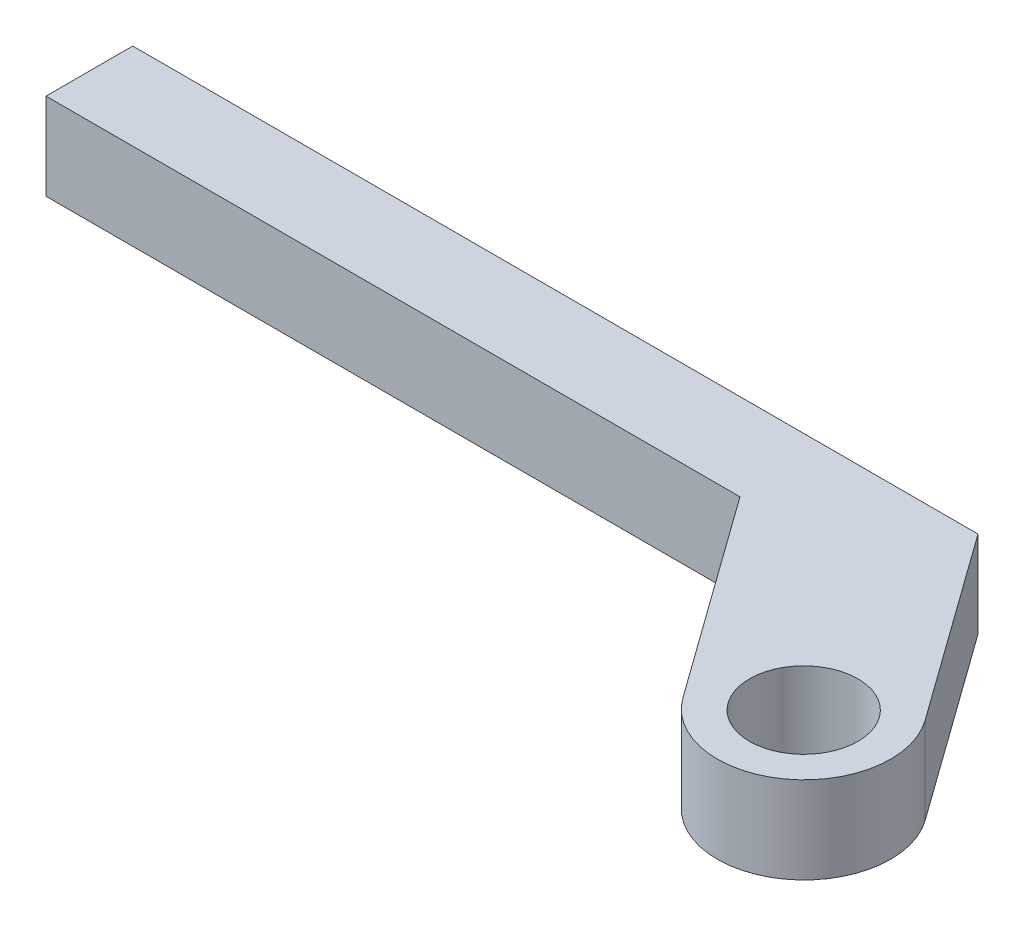
ISO-10303-21;
HEADER;
FILE_DESCRIPTION(('STEP AP214'),'2;1');
FILE_NAME('part.step','',(''),(''),'','','');
FILE_SCHEMA(('AUTOMOTIVE_DESIGN { 1 0 10303 214 1 1 1 1 }'));
ENDSEC;
DATA;
#1=APPLICATION_CONTEXT('core data for automotive mechanical design processes');
#2=APPLICATION_PROTOCOL_DEFINITION('international standard','automotive_design',2000,#1);
#3=PRODUCT_CONTEXT('',#1,'mechanical');
#4=PRODUCT('Part','Part','',(#3));
#5=PRODUCT_RELATED_PRODUCT_CATEGORY('part','',(#4));
#6=PRODUCT_DEFINITION_FORMATION('','',#4);
#7=PRODUCT_DEFINITION_CONTEXT('part definition',#1,'design');
#8=PRODUCT_DEFINITION('design','',#6,#7);
#9=PRODUCT_DEFINITION_SHAPE('','',#8);
#10=(LENGTH_UNIT() NAMED_UNIT(*) SI_UNIT(.MILLI.,.METRE.));
#11=(NAMED_UNIT(*) PLANE_ANGLE_UNIT() SI_UNIT($,.RADIAN.));
#12=(NAMED_UNIT(*) SI_UNIT($,.STERADIAN.) SOLID_ANGLE_UNIT());
#13=UNCERTAINTY_MEASURE_WITH_UNIT(LENGTH_MEASURE(1.E-05),#10,'distance_accuracy_value','');
#14=(GEOMETRIC_REPRESENTATION_CONTEXT(3) GLOBAL_UNCERTAINTY_ASSIGNED_CONTEXT((#13)) GLOBAL_UNIT_ASSIGNED_CONTEXT((#10,
#11,#12)) REPRESENTATION_CONTEXT('',''));
#15=CARTESIAN_POINT('',(0.,0.,0.));
#16=DIRECTION('',(0.,0.,1.));
#17=DIRECTION('',(1.,0.,0.));
#18=AXIS2_PLACEMENT_3D('',#15,#16,#17);
#19=CARTESIAN_POINT('',(5.16334827051863,6.35,11.4304782421103));
#20=DIRECTION('',(0.,-1.,0.));
#21=DIRECTION('',(0.,0.,-1.));
#22=AXIS2_PLACEMENT_3D('',#19,#20,#21);
#23=CYLINDRICAL_SURFACE('',#22,6.35);
#24=CARTESIAN_POINT('',(5.16334827051863,0.,11.4304782421103));
#25=DIRECTION('',(0.,1.,0.));
#26=DIRECTION('',(0.,0.,1.));
#27=AXIS2_PLACEMENT_3D('',#24,#25,#26);
#28=CIRCLE('',#27,6.35);
#29=CARTESIAN_POINT('',(0.00624650025432636,0.,15.1354480572555));
#30=VERTEX_POINT('',#29);
#31=CARTESIAN_POINT('',(10.3204500407829,0.,7.72550842696519));
#32=VERTEX_POINT('',#31);
#33=EDGE_CURVE('E138',#30,#32,#28,.T.);
#34=ORIENTED_EDGE('',*,*,#33,.T.);
#35=DIRECTION('',(0.,-1.,0.));
#36=VECTOR('',#35,1.);
#37=CARTESIAN_POINT('',(10.3204500407829,6.35,7.72550842696519));
#38=LINE('',#37,#36);
#39=CARTESIAN_POINT('',(10.3204500407829,6.35,7.72550842696519));
#40=VERTEX_POINT('',#39);
#41=EDGE_CURVE('E11',#40,#32,#38,.T.);
#42=ORIENTED_EDGE('',*,*,#41,.F.);
#43=CARTESIAN_POINT('',(5.16334827051863,6.35,11.4304782421103));
#44=DIRECTION('',(0.,1.,0.));
#45=DIRECTION('',(0.,0.,1.));
#46=AXIS2_PLACEMENT_3D('',#43,#44,#45);
#47=CIRCLE('',#46,6.35);
#48=CARTESIAN_POINT('',(0.00624650025432636,6.35,15.1354480572555));
#49=VERTEX_POINT('',#48);
#50=EDGE_CURVE('E156',#49,#40,#47,.T.);
#51=ORIENTED_EDGE('',*,*,#50,.F.);
#52=DIRECTION('',(0.,-1.,0.));
#53=VECTOR('',#52,1.);
#54=CARTESIAN_POINT('',(0.00624650025432636,6.35,15.1354480572555));
#55=LINE('',#54,#53);
#56=EDGE_CURVE('E134',#49,#30,#55,.T.);
#57=ORIENTED_EDGE('',*,*,#56,.T.);
#58=EDGE_LOOP('',(#34,#42,#51,#57));
#59=FACE_BOUND('',#58,.T.);
#60=ADVANCED_FACE('F49',(#59),#23,.T.);
#61=CARTESIAN_POINT('',(10.3204500407829,6.35,7.72550842696519));
#62=DIRECTION('',(-0.812142011065245,0.,0.583459813408687));
#63=DIRECTION('',(0.583459813408687,0.,0.812142011065245));
#64=AXIS2_PLACEMENT_3D('',#61,#62,#63);
#65=PLANE('',#64);
#66=DIRECTION('',(-0.583459813408687,0.,-0.812142011065245));
#67=VECTOR('',#66,1.);
#68=CARTESIAN_POINT('',(10.3204500407829,0.,7.72550842696519));
#69=LINE('',#68,#67);
#70=CARTESIAN_POINT('',(0.43675250358592,0.,-6.03202175788967));
#71=VERTEX_POINT('',#70);
#72=EDGE_CURVE('E142',#32,#71,#69,.T.);
#73=ORIENTED_EDGE('',*,*,#72,.T.);
#74=DIRECTION('',(0.,-1.,0.));
#75=VECTOR('',#74,1.);
#76=CARTESIAN_POINT('',(0.43675250358592,6.35,-6.03202175788967));
#77=LINE('',#76,#75);
#78=CARTESIAN_POINT('',(0.43675250358592,6.35,-6.03202175788967));
#79=VERTEX_POINT('',#78);
#80=EDGE_CURVE('E58',#79,#71,#77,.T.);
#81=ORIENTED_EDGE('',*,*,#80,.F.);
#82=DIRECTION('',(-0.583459813408687,0.,-0.812142011065245));
#83=VECTOR('',#82,1.);
#84=CARTESIAN_POINT('',(10.3204500407829,6.35,7.72550842696519));
#85=LINE('',#84,#83);
#86=EDGE_CURVE('E103',#40,#79,#85,.T.);
#87=ORIENTED_EDGE('',*,*,#86,.F.);
#88=ORIENTED_EDGE('',*,*,#41,.T.);
#89=EDGE_LOOP('',(#73,#81,#87,#88));
#90=FACE_BOUND('',#89,.T.);
#91=ADVANCED_FACE('F166',(#90),#65,.F.);
#92=CARTESIAN_POINT('',(-61.4389338447369,6.35,-6.03202175788967));
#93=DIRECTION('',(0.,0.,1.));
#94=DIRECTION('',(1.,0.,0.));
#95=AXIS2_PLACEMENT_3D('',#92,#93,#94);
#96=PLANE('',#95);
#97=DIRECTION('',(-1.,0.,0.));
#98=VECTOR('',#97,1.);
#99=CARTESIAN_POINT('',(-61.4389338447369,0.,-6.03202175788967));
#100=LINE('',#99,#98);
#101=CARTESIAN_POINT('',(-61.4389338447369,0.,-6.03202175788967));
#102=VERTEX_POINT('',#101);
#103=EDGE_CURVE('E147',#71,#102,#100,.T.);
#104=ORIENTED_EDGE('',*,*,#103,.T.);
#105=DIRECTION('',(0.,-1.,0.));
#106=VECTOR('',#105,1.);
#107=CARTESIAN_POINT('',(-61.4389338447369,6.35,-6.03202175788967));
#108=LINE('',#107,#106);
#109=CARTESIAN_POINT('',(-61.4389338447369,6.35,-6.03202175788967));
#110=VERTEX_POINT('',#109);
#111=EDGE_CURVE('E127',#110,#102,#108,.T.);
#112=ORIENTED_EDGE('',*,*,#111,.F.);
#113=DIRECTION('',(-1.,0.,0.));
#114=VECTOR('',#113,1.);
#115=CARTESIAN_POINT('',(-10.638933844737,6.35,-6.03202175788967));
#116=LINE('',#115,#114);
#117=EDGE_CURVE('E116',#79,#110,#116,.T.);
#118=ORIENTED_EDGE('',*,*,#117,.F.);
#119=ORIENTED_EDGE('',*,*,#80,.T.);
#120=EDGE_LOOP('',(#104,#112,#118,#119));
#121=FACE_BOUND('',#120,.T.);
#122=ADVANCED_FACE('F165',(#121),#96,.F.);
#123=CARTESIAN_POINT('',(-61.4389338447369,6.35,-6.03202175788967));
#124=DIRECTION('',(1.,0.,0.));
#125=DIRECTION('',(0.,0.,-1.));
#126=AXIS2_PLACEMENT_3D('',#123,#124,#125);
#127=PLANE('',#126);
#128=DIRECTION('',(0.,0.,1.));
#129=VECTOR('',#128,1.);
#130=CARTESIAN_POINT('',(-61.4389338447369,0.,-6.03202175788967));
#131=LINE('',#130,#129);
#132=CARTESIAN_POINT('',(-61.4389338447369,0.,0.317978242110335));
#133=VERTEX_POINT('',#132);
#134=EDGE_CURVE('E125',#102,#133,#131,.T.);
#135=ORIENTED_EDGE('',*,*,#134,.T.);
#136=DIRECTION('',(0.,-1.,0.));
#137=VECTOR('',#136,1.);
#138=CARTESIAN_POINT('',(-61.4389338447369,6.35,0.317978242110335));
#139=LINE('',#138,#137);
#140=CARTESIAN_POINT('',(-61.4389338447369,6.35,0.317978242110335));
#141=VERTEX_POINT('',#140);
#142=EDGE_CURVE('E122',#141,#133,#139,.T.);
#143=ORIENTED_EDGE('',*,*,#142,.F.);
#144=DIRECTION('',(0.,0.,1.));
#145=VECTOR('',#144,1.);
#146=CARTESIAN_POINT('',(-61.4389338447369,6.35,-6.03202175788967));
#147=LINE('',#146,#145);
#148=EDGE_CURVE('E110',#110,#141,#147,.T.);
#149=ORIENTED_EDGE('',*,*,#148,.F.);
#150=ORIENTED_EDGE('',*,*,#111,.T.);
#151=EDGE_LOOP('',(#135,#143,#149,#150));
#152=FACE_BOUND('',#151,.T.);
#153=ADVANCED_FACE('F123',(#152),#127,.F.);
#154=CARTESIAN_POINT('',(-61.4389338447369,6.35,0.317978242110335));
#155=DIRECTION('',(0.,0.,-1.));
#156=DIRECTION('',(-1.,0.,0.));
#157=AXIS2_PLACEMENT_3D('',#154,#155,#156);
#158=PLANE('',#157);
#159=DIRECTION('',(1.,0.,0.));
#160=VECTOR('',#159,1.);
#161=CARTESIAN_POINT('',(-61.4389338447369,0.,0.317978242110335));
#162=LINE('',#161,#160);
#163=CARTESIAN_POINT('',(-10.638933844737,0.,0.317978242110335));
#164=VERTEX_POINT('',#163);
#165=EDGE_CURVE('E89',#133,#164,#162,.T.);
#166=ORIENTED_EDGE('',*,*,#165,.T.);
#167=DIRECTION('',(0.,-1.,0.));
#168=VECTOR('',#167,1.);
#169=CARTESIAN_POINT('',(-10.638933844737,6.35,0.317978242110335));
#170=LINE('',#169,#168);
#171=CARTESIAN_POINT('',(-10.638933844737,6.35,0.317978242110335));
#172=VERTEX_POINT('',#171);
#173=EDGE_CURVE('E128',#172,#164,#170,.T.);
#174=ORIENTED_EDGE('',*,*,#173,.F.);
#175=DIRECTION('',(1.,0.,0.));
#176=VECTOR('',#175,1.);
#177=CARTESIAN_POINT('',(-61.4389338447369,6.35,0.317978242110335));
#178=LINE('',#177,#176);
#179=EDGE_CURVE('E114',#141,#172,#178,.T.);
#180=ORIENTED_EDGE('',*,*,#179,.F.);
#181=ORIENTED_EDGE('',*,*,#142,.T.);
#182=EDGE_LOOP('',(#166,#174,#180,#181));
#183=FACE_BOUND('',#182,.T.);
#184=ADVANCED_FACE('F130',(#183),#158,.F.);
#185=CARTESIAN_POINT('',(-10.638933844737,6.35,0.317978242110335));
#186=DIRECTION('',(0.812142011065245,0.,-0.583459813408686));
#187=DIRECTION('',(-0.583459813408686,0.,-0.812142011065245));
#188=AXIS2_PLACEMENT_3D('',#185,#186,#187);
#189=PLANE('',#188);
#190=DIRECTION('',(0.583459813408686,0.,0.812142011065245));
#191=VECTOR('',#190,1.);
#192=CARTESIAN_POINT('',(-10.638933844737,0.,0.317978242110335));
#193=LINE('',#192,#191);
#194=EDGE_CURVE('E95',#164,#30,#193,.T.);
#195=ORIENTED_EDGE('',*,*,#194,.T.);
#196=ORIENTED_EDGE('',*,*,#56,.F.);
#197=DIRECTION('',(0.583459813408686,0.,0.812142011065245));
#198=VECTOR('',#197,1.);
#199=CARTESIAN_POINT('',(-10.638933844737,6.35,0.317978242110335));
#200=LINE('',#199,#198);
#201=EDGE_CURVE('E66',#172,#49,#200,.T.);
#202=ORIENTED_EDGE('',*,*,#201,.F.);
#203=ORIENTED_EDGE('',*,*,#173,.T.);
#204=EDGE_LOOP('',(#195,#196,#202,#203));
#205=FACE_BOUND('',#204,.T.);
#206=ADVANCED_FACE('F173',(#205),#189,.F.);
#207=CARTESIAN_POINT('',(5.16334827051863,6.35,11.4304782421103));
#208=DIRECTION('',(0.,1.,0.));
#209=DIRECTION('',(0.,0.,1.));
#210=AXIS2_PLACEMENT_3D('',#207,#208,#209);
#211=PLANE('',#210);
#212=CARTESIAN_POINT('',(5.21873979549698,6.35,11.5075800123746));
#213=DIRECTION('',(0.,1.,0.));
#214=DIRECTION('',(0.,0.,1.));
#215=AXIS2_PLACEMENT_3D('',#212,#213,#214);
#216=CIRCLE('',#215,3.96875);
#217=CARTESIAN_POINT('',(5.21873979549698,6.35,15.4763300123746));
#218=VERTEX_POINT('',#217);
#219=EDGE_CURVE('E248',#218,#218,#216,.T.);
#220=ORIENTED_EDGE('',*,*,#219,.F.);
#221=EDGE_LOOP('',(#220));
#222=FACE_BOUND('',#221,.T.);
#223=ORIENTED_EDGE('',*,*,#50,.T.);
#224=ORIENTED_EDGE('',*,*,#86,.T.);
#225=ORIENTED_EDGE('',*,*,#117,.T.);
#226=ORIENTED_EDGE('',*,*,#148,.T.);
#227=ORIENTED_EDGE('',*,*,#179,.T.);
#228=ORIENTED_EDGE('',*,*,#201,.T.);
#229=EDGE_LOOP('',(#223,#224,#225,#226,#227,#228));
#230=FACE_BOUND('',#229,.T.);
#231=ADVANCED_FACE('F112',(#222,#230),#211,.T.);
#232=CARTESIAN_POINT('',(5.16334827051863,0.,11.4304782421103));
#233=DIRECTION('',(0.,1.,0.));
#234=DIRECTION('',(0.,0.,1.));
#235=AXIS2_PLACEMENT_3D('',#232,#233,#234);
#236=PLANE('',#235);
#237=CARTESIAN_POINT('',(5.21873979549698,0.,11.5075800123746));
#238=DIRECTION('',(0.,1.,0.));
#239=DIRECTION('',(0.,0.,1.));
#240=AXIS2_PLACEMENT_3D('',#237,#238,#239);
#241=CIRCLE('',#240,3.96875);
#242=CARTESIAN_POINT('',(5.21873979549698,0.,15.4763300123746));
#243=VERTEX_POINT('',#242);
#244=EDGE_CURVE('E143',#243,#243,#241,.T.);
#245=ORIENTED_EDGE('',*,*,#244,.T.);
#246=EDGE_LOOP('',(#245));
#247=FACE_BOUND('',#246,.T.);
#248=ORIENTED_EDGE('',*,*,#33,.F.);
#249=ORIENTED_EDGE('',*,*,#194,.F.);
#250=ORIENTED_EDGE('',*,*,#165,.F.);
#251=ORIENTED_EDGE('',*,*,#134,.F.);
#252=ORIENTED_EDGE('',*,*,#103,.F.);
#253=ORIENTED_EDGE('',*,*,#72,.F.);
#254=EDGE_LOOP('',(#248,#249,#250,#251,#252,#253));
#255=FACE_BOUND('',#254,.T.);
#256=ADVANCED_FACE('F170',(#247,#255),#236,.F.);
#257=CARTESIAN_POINT('',(5.21873979549698,6.35,11.5075800123746));
#258=DIRECTION('',(0.,1.,0.));
#259=DIRECTION('',(0.,0.,1.));
#260=AXIS2_PLACEMENT_3D('',#257,#258,#259);
#261=CYLINDRICAL_SURFACE('',#260,3.96875);
#262=ORIENTED_EDGE('',*,*,#244,.F.);
#263=EDGE_LOOP('',(#262));
#264=FACE_BOUND('',#263,.T.);
#265=ORIENTED_EDGE('',*,*,#219,.T.);
#266=EDGE_LOOP('',(#265));
#267=FACE_BOUND('',#266,.T.);
#268=ADVANCED_FACE('F225',(#264,#267),#261,.F.);
#269=CLOSED_SHELL('',(#60,#91,#122,#153,#184,#206,#231,#256,#268));
#270=MANIFOLD_SOLID_BREP('B2',#269);
#271=ADVANCED_BREP_SHAPE_REPRESENTATION('',(#18,#270),#14);
#272=SHAPE_DEFINITION_REPRESENTATION(#9,#271);
ENDSEC;
END-ISO-10303-21;
